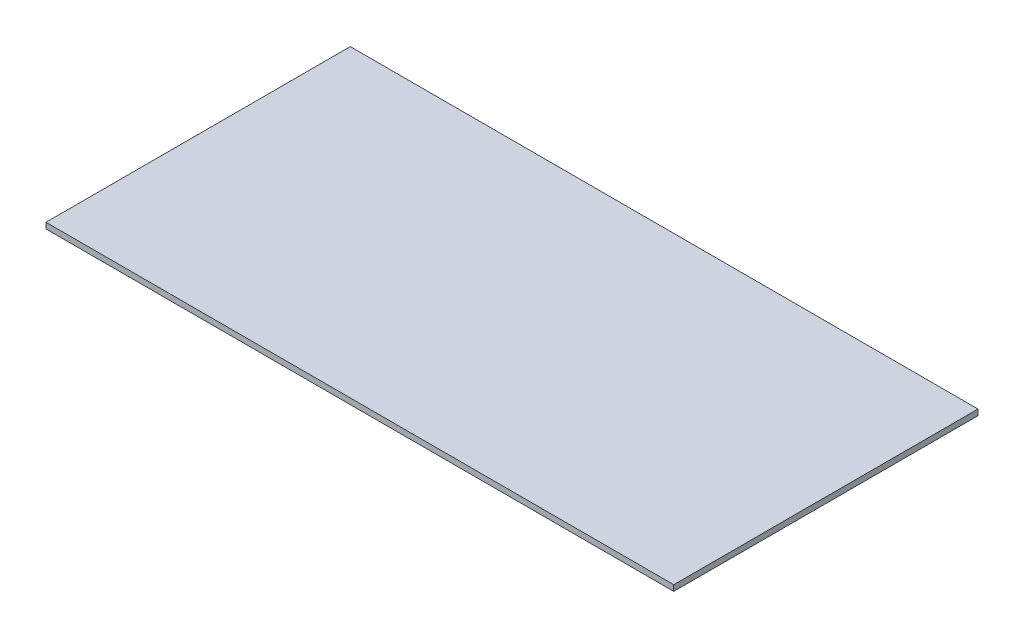
ISO-10303-21;
HEADER;
FILE_DESCRIPTION(('STEP AP214'),'2;1');
FILE_NAME('part.step','',(''),(''),'','','');
FILE_SCHEMA(('AUTOMOTIVE_DESIGN { 1 0 10303 214 1 1 1 1 }'));
ENDSEC;
DATA;
#1=APPLICATION_CONTEXT('core data for automotive mechanical design processes');
#2=APPLICATION_PROTOCOL_DEFINITION('international standard','automotive_design',2000,#1);
#3=PRODUCT_CONTEXT('',#1,'mechanical');
#4=PRODUCT('Part','Part','',(#3));
#5=PRODUCT_RELATED_PRODUCT_CATEGORY('part','',(#4));
#6=PRODUCT_DEFINITION_FORMATION('','',#4);
#7=PRODUCT_DEFINITION_CONTEXT('part definition',#1,'design');
#8=PRODUCT_DEFINITION('design','',#6,#7);
#9=PRODUCT_DEFINITION_SHAPE('','',#8);
#10=(LENGTH_UNIT() NAMED_UNIT(*) SI_UNIT(.MILLI.,.METRE.));
#11=(NAMED_UNIT(*) PLANE_ANGLE_UNIT() SI_UNIT($,.RADIAN.));
#12=(NAMED_UNIT(*) SI_UNIT($,.STERADIAN.) SOLID_ANGLE_UNIT());
#13=UNCERTAINTY_MEASURE_WITH_UNIT(LENGTH_MEASURE(1.E-05),#10,'distance_accuracy_value','');
#14=(GEOMETRIC_REPRESENTATION_CONTEXT(3) GLOBAL_UNCERTAINTY_ASSIGNED_CONTEXT((#13)) GLOBAL_UNIT_ASSIGNED_CONTEXT((#10,
#11,#12)) REPRESENTATION_CONTEXT('',''));
#15=CARTESIAN_POINT('',(0.,0.,0.));
#16=DIRECTION('',(0.,0.,1.));
#17=DIRECTION('',(1.,0.,0.));
#18=AXIS2_PLACEMENT_3D('',#15,#16,#17);
#19=CARTESIAN_POINT('',(65.50787,1.21412,31.75));
#20=DIRECTION('',(-1.,0.,0.));
#21=DIRECTION('',(0.,0.,1.));
#22=AXIS2_PLACEMENT_3D('',#19,#20,#21);
#23=PLANE('',#22);
#24=DIRECTION('',(0.,0.,-1.));
#25=VECTOR('',#24,1.);
#26=CARTESIAN_POINT('',(65.50787,0.,31.75));
#27=LINE('',#26,#25);
#28=CARTESIAN_POINT('',(65.50787,0.,31.75));
#29=VERTEX_POINT('',#28);
#30=CARTESIAN_POINT('',(65.50787,0.,-31.75));
#31=VERTEX_POINT('',#30);
#32=EDGE_CURVE('E111',#29,#31,#27,.T.);
#33=ORIENTED_EDGE('',*,*,#32,.T.);
#34=DIRECTION('',(0.,-1.,0.));
#35=VECTOR('',#34,1.);
#36=CARTESIAN_POINT('',(65.50787,1.21412,-31.75));
#37=LINE('',#36,#35);
#38=CARTESIAN_POINT('',(65.50787,1.21412,-31.75));
#39=VERTEX_POINT('',#38);
#40=EDGE_CURVE('E11',#39,#31,#37,.T.);
#41=ORIENTED_EDGE('',*,*,#40,.F.);
#42=DIRECTION('',(0.,0.,-1.));
#43=VECTOR('',#42,1.);
#44=CARTESIAN_POINT('',(65.50787,1.21412,31.75));
#45=LINE('',#44,#43);
#46=CARTESIAN_POINT('',(65.50787,1.21412,31.75));
#47=VERTEX_POINT('',#46);
#48=EDGE_CURVE('E95',#47,#39,#45,.T.);
#49=ORIENTED_EDGE('',*,*,#48,.F.);
#50=DIRECTION('',(0.,-1.,0.));
#51=VECTOR('',#50,1.);
#52=CARTESIAN_POINT('',(65.50787,1.21412,31.75));
#53=LINE('',#52,#51);
#54=EDGE_CURVE('E107',#47,#29,#53,.T.);
#55=ORIENTED_EDGE('',*,*,#54,.T.);
#56=EDGE_LOOP('',(#33,#41,#49,#55));
#57=FACE_BOUND('',#56,.T.);
#58=ADVANCED_FACE('F43',(#57),#23,.F.);
#59=CARTESIAN_POINT('',(-65.50787,1.21412,-31.75));
#60=DIRECTION('',(0.,0.,1.));
#61=DIRECTION('',(1.,0.,0.));
#62=AXIS2_PLACEMENT_3D('',#59,#60,#61);
#63=PLANE('',#62);
#64=DIRECTION('',(-1.,0.,0.));
#65=VECTOR('',#64,1.);
#66=CARTESIAN_POINT('',(-65.50787,0.,-31.75));
#67=LINE('',#66,#65);
#68=CARTESIAN_POINT('',(-65.50787,0.,-31.75));
#69=VERTEX_POINT('',#68);
#70=EDGE_CURVE('E100',#31,#69,#67,.T.);
#71=ORIENTED_EDGE('',*,*,#70,.T.);
#72=DIRECTION('',(0.,-1.,0.));
#73=VECTOR('',#72,1.);
#74=CARTESIAN_POINT('',(-65.50787,1.21412,-31.75));
#75=LINE('',#74,#73);
#76=CARTESIAN_POINT('',(-65.50787,1.21412,-31.75));
#77=VERTEX_POINT('',#76);
#78=EDGE_CURVE('E52',#77,#69,#75,.T.);
#79=ORIENTED_EDGE('',*,*,#78,.F.);
#80=DIRECTION('',(-1.,0.,0.));
#81=VECTOR('',#80,1.);
#82=CARTESIAN_POINT('',(-65.50787,1.21412,-31.75));
#83=LINE('',#82,#81);
#84=EDGE_CURVE('E90',#39,#77,#83,.T.);
#85=ORIENTED_EDGE('',*,*,#84,.F.);
#86=ORIENTED_EDGE('',*,*,#40,.T.);
#87=EDGE_LOOP('',(#71,#79,#85,#86));
#88=FACE_BOUND('',#87,.T.);
#89=ADVANCED_FACE('F99',(#88),#63,.F.);
#90=CARTESIAN_POINT('',(-65.50787,1.21412,31.75));
#91=DIRECTION('',(1.,0.,0.));
#92=DIRECTION('',(0.,0.,-1.));
#93=AXIS2_PLACEMENT_3D('',#90,#91,#92);
#94=PLANE('',#93);
#95=DIRECTION('',(0.,0.,1.));
#96=VECTOR('',#95,1.);
#97=CARTESIAN_POINT('',(-65.50787,0.,31.75));
#98=LINE('',#97,#96);
#99=CARTESIAN_POINT('',(-65.50787,0.,31.75));
#100=VERTEX_POINT('',#99);
#101=EDGE_CURVE('E77',#69,#100,#98,.T.);
#102=ORIENTED_EDGE('',*,*,#101,.T.);
#103=DIRECTION('',(0.,-1.,0.));
#104=VECTOR('',#103,1.);
#105=CARTESIAN_POINT('',(-65.50787,1.21412,31.75));
#106=LINE('',#105,#104);
#107=CARTESIAN_POINT('',(-65.50787,1.21412,31.75));
#108=VERTEX_POINT('',#107);
#109=EDGE_CURVE('E102',#108,#100,#106,.T.);
#110=ORIENTED_EDGE('',*,*,#109,.F.);
#111=DIRECTION('',(0.,0.,1.));
#112=VECTOR('',#111,1.);
#113=CARTESIAN_POINT('',(-65.50787,1.21412,31.75));
#114=LINE('',#113,#112);
#115=EDGE_CURVE('E93',#77,#108,#114,.T.);
#116=ORIENTED_EDGE('',*,*,#115,.F.);
#117=ORIENTED_EDGE('',*,*,#78,.T.);
#118=EDGE_LOOP('',(#102,#110,#116,#117));
#119=FACE_BOUND('',#118,.T.);
#120=ADVANCED_FACE('F103',(#119),#94,.F.);
#121=CARTESIAN_POINT('',(-65.50787,1.21412,31.75));
#122=DIRECTION('',(0.,0.,-1.));
#123=DIRECTION('',(-1.,0.,0.));
#124=AXIS2_PLACEMENT_3D('',#121,#122,#123);
#125=PLANE('',#124);
#126=DIRECTION('',(1.,0.,0.));
#127=VECTOR('',#126,1.);
#128=CARTESIAN_POINT('',(-65.50787,0.,31.75));
#129=LINE('',#128,#127);
#130=EDGE_CURVE('E83',#100,#29,#129,.T.);
#131=ORIENTED_EDGE('',*,*,#130,.T.);
#132=ORIENTED_EDGE('',*,*,#54,.F.);
#133=DIRECTION('',(1.,0.,0.));
#134=VECTOR('',#133,1.);
#135=CARTESIAN_POINT('',(-65.50787,1.21412,31.75));
#136=LINE('',#135,#134);
#137=EDGE_CURVE('E60',#108,#47,#136,.T.);
#138=ORIENTED_EDGE('',*,*,#137,.F.);
#139=ORIENTED_EDGE('',*,*,#109,.T.);
#140=EDGE_LOOP('',(#131,#132,#138,#139));
#141=FACE_BOUND('',#140,.T.);
#142=ADVANCED_FACE('F124',(#141),#125,.F.);
#143=CARTESIAN_POINT('',(0.,1.21412,0.));
#144=DIRECTION('',(0.,-1.,0.));
#145=DIRECTION('',(0.,0.,-1.));
#146=AXIS2_PLACEMENT_3D('',#143,#144,#145);
#147=PLANE('',#146);
#148=ORIENTED_EDGE('',*,*,#48,.T.);
#149=ORIENTED_EDGE('',*,*,#84,.T.);
#150=ORIENTED_EDGE('',*,*,#115,.T.);
#151=ORIENTED_EDGE('',*,*,#137,.T.);
#152=EDGE_LOOP('',(#148,#149,#150,#151));
#153=FACE_BOUND('',#152,.T.);
#154=ADVANCED_FACE('F91',(#153),#147,.F.);
#155=CARTESIAN_POINT('',(0.,0.,0.));
#156=DIRECTION('',(0.,-1.,0.));
#157=DIRECTION('',(0.,0.,-1.));
#158=AXIS2_PLACEMENT_3D('',#155,#156,#157);
#159=PLANE('',#158);
#160=ORIENTED_EDGE('',*,*,#32,.F.);
#161=ORIENTED_EDGE('',*,*,#130,.F.);
#162=ORIENTED_EDGE('',*,*,#101,.F.);
#163=ORIENTED_EDGE('',*,*,#70,.F.);
#164=EDGE_LOOP('',(#160,#161,#162,#163));
#165=FACE_BOUND('',#164,.T.);
#166=ADVANCED_FACE('F127',(#165),#159,.T.);
#167=CLOSED_SHELL('',(#58,#89,#120,#142,#154,#166));
#168=MANIFOLD_SOLID_BREP('B2',#167);
#169=ADVANCED_BREP_SHAPE_REPRESENTATION('',(#18,#168),#14);
#170=SHAPE_DEFINITION_REPRESENTATION(#9,#169);
ENDSEC;
END-ISO-10303-21;
